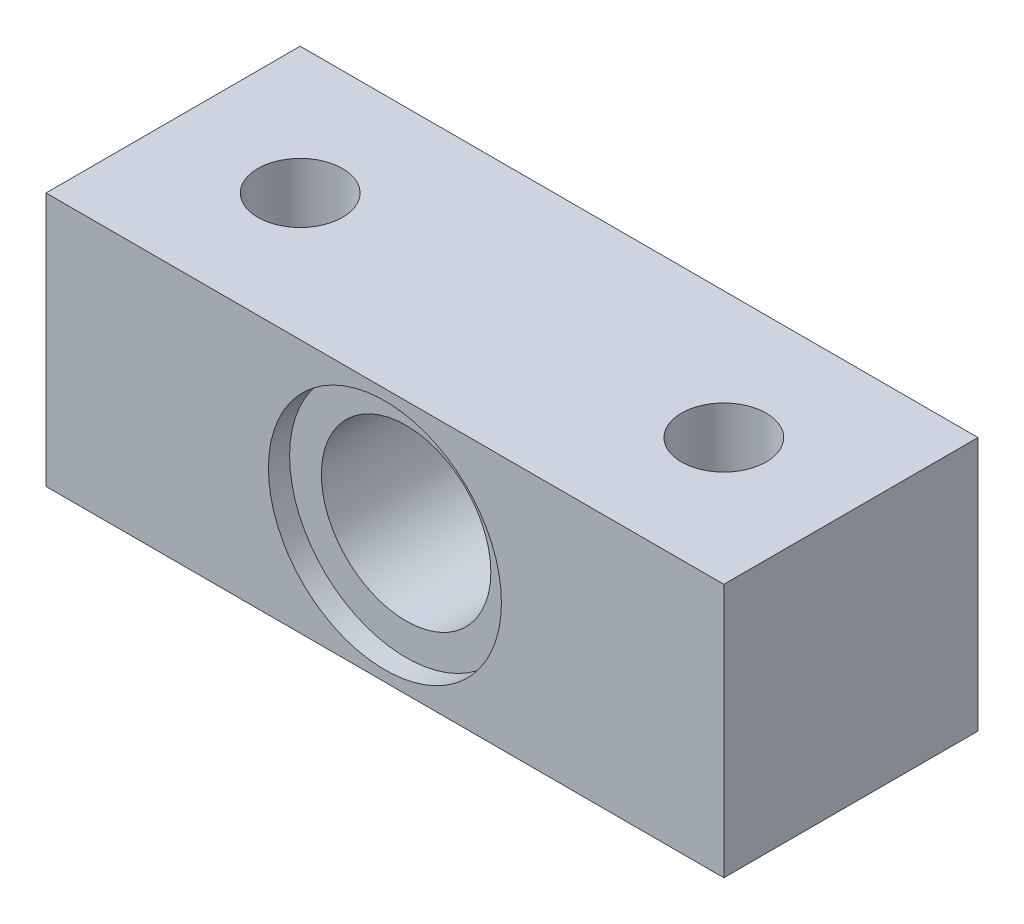
ISO-10303-21;
HEADER;
FILE_DESCRIPTION(('STEP AP214'),'2;1');
FILE_NAME('part.step','',(''),(''),'','','');
FILE_SCHEMA(('AUTOMOTIVE_DESIGN { 1 0 10303 214 1 1 1 1 }'));
ENDSEC;
DATA;
#1=APPLICATION_CONTEXT('core data for automotive mechanical design processes');
#2=APPLICATION_PROTOCOL_DEFINITION('international standard','automotive_design',2000,#1);
#3=PRODUCT_CONTEXT('',#1,'mechanical');
#4=PRODUCT('Part','Part','',(#3));
#5=PRODUCT_RELATED_PRODUCT_CATEGORY('part','',(#4));
#6=PRODUCT_DEFINITION_FORMATION('','',#4);
#7=PRODUCT_DEFINITION_CONTEXT('part definition',#1,'design');
#8=PRODUCT_DEFINITION('design','',#6,#7);
#9=PRODUCT_DEFINITION_SHAPE('','',#8);
#10=(LENGTH_UNIT() NAMED_UNIT(*) SI_UNIT(.MILLI.,.METRE.));
#11=(NAMED_UNIT(*) PLANE_ANGLE_UNIT() SI_UNIT($,.RADIAN.));
#12=(NAMED_UNIT(*) SI_UNIT($,.STERADIAN.) SOLID_ANGLE_UNIT());
#13=UNCERTAINTY_MEASURE_WITH_UNIT(LENGTH_MEASURE(1.E-05),#10,'distance_accuracy_value','');
#14=(GEOMETRIC_REPRESENTATION_CONTEXT(3) GLOBAL_UNCERTAINTY_ASSIGNED_CONTEXT((#13)) GLOBAL_UNIT_ASSIGNED_CONTEXT((#10,
#11,#12)) REPRESENTATION_CONTEXT('',''));
#15=CARTESIAN_POINT('',(0.,0.,0.));
#16=DIRECTION('',(0.,0.,1.));
#17=DIRECTION('',(1.,0.,0.));
#18=AXIS2_PLACEMENT_3D('',#15,#16,#17);
#19=CARTESIAN_POINT('',(15.875,12.8905,9.525));
#20=DIRECTION('',(0.,-1.,0.));
#21=DIRECTION('',(0.,0.,-1.));
#22=AXIS2_PLACEMENT_3D('',#19,#20,#21);
#23=CYLINDRICAL_SURFACE('',#22,3.175);
#24=CARTESIAN_POINT('',(15.875,9.525,9.525));
#25=DIRECTION('',(0.,-1.,0.));
#26=DIRECTION('',(0.,0.,-1.));
#27=AXIS2_PLACEMENT_3D('',#24,#25,#26);
#28=CIRCLE('',#27,3.175);
#29=CARTESIAN_POINT('',(15.875,9.525,6.35));
#30=VERTEX_POINT('',#29);
#31=EDGE_CURVE('E112',#30,#30,#28,.T.);
#32=ORIENTED_EDGE('',*,*,#31,.F.);
#33=EDGE_LOOP('',(#32));
#34=FACE_BOUND('',#33,.T.);
#35=CARTESIAN_POINT('',(15.875,-3.175,9.525));
#36=DIRECTION('',(0.,-1.,0.));
#37=DIRECTION('',(0.,0.,-1.));
#38=AXIS2_PLACEMENT_3D('',#35,#36,#37);
#39=CIRCLE('',#38,3.175);
#40=CARTESIAN_POINT('',(15.875,-3.175,6.35));
#41=VERTEX_POINT('',#40);
#42=EDGE_CURVE('E35',#41,#41,#39,.F.);
#43=ORIENTED_EDGE('',*,*,#42,.F.);
#44=EDGE_LOOP('',(#43));
#45=FACE_BOUND('',#44,.T.);
#46=ADVANCED_FACE('F31',(#34,#45),#23,.F.);
#47=CARTESIAN_POINT('',(-15.875,12.8905,9.525));
#48=DIRECTION('',(0.,-1.,0.));
#49=DIRECTION('',(0.,0.,-1.));
#50=AXIS2_PLACEMENT_3D('',#47,#48,#49);
#51=CYLINDRICAL_SURFACE('',#50,3.175);
#52=CARTESIAN_POINT('',(-15.875,9.525,9.525));
#53=DIRECTION('',(0.,-1.,0.));
#54=DIRECTION('',(0.,0.,-1.));
#55=AXIS2_PLACEMENT_3D('',#52,#53,#54);
#56=CIRCLE('',#55,3.175);
#57=CARTESIAN_POINT('',(-15.875,9.525,6.35));
#58=VERTEX_POINT('',#57);
#59=EDGE_CURVE('E117',#58,#58,#56,.T.);
#60=ORIENTED_EDGE('',*,*,#59,.F.);
#61=EDGE_LOOP('',(#60));
#62=FACE_BOUND('',#61,.T.);
#63=CARTESIAN_POINT('',(-15.875,-3.175,9.525));
#64=DIRECTION('',(0.,-1.,0.));
#65=DIRECTION('',(0.,0.,-1.));
#66=AXIS2_PLACEMENT_3D('',#63,#64,#65);
#67=CIRCLE('',#66,3.175);
#68=CARTESIAN_POINT('',(-15.875,-3.175,6.35));
#69=VERTEX_POINT('',#68);
#70=EDGE_CURVE('E110',#69,#69,#67,.F.);
#71=ORIENTED_EDGE('',*,*,#70,.F.);
#72=EDGE_LOOP('',(#71));
#73=FACE_BOUND('',#72,.T.);
#74=ADVANCED_FACE('F145',(#62,#73),#51,.F.);
#75=CARTESIAN_POINT('',(0.,0.,19.05));
#76=DIRECTION('',(0.,0.,-1.));
#77=DIRECTION('',(-1.,0.,0.));
#78=AXIS2_PLACEMENT_3D('',#75,#76,#77);
#79=CYLINDRICAL_SURFACE('',#78,6.35);
#80=CARTESIAN_POINT('',(0.,0.,0.));
#81=DIRECTION('',(0.,0.,1.));
#82=DIRECTION('',(1.,0.,0.));
#83=AXIS2_PLACEMENT_3D('',#80,#81,#82);
#84=CIRCLE('',#83,6.35);
#85=CARTESIAN_POINT('',(6.35,0.,0.));
#86=VERTEX_POINT('',#85);
#87=EDGE_CURVE('E101',#86,#86,#84,.T.);
#88=ORIENTED_EDGE('',*,*,#87,.F.);
#89=EDGE_LOOP('',(#88));
#90=FACE_BOUND('',#89,.T.);
#91=CARTESIAN_POINT('',(0.,0.,17.4625));
#92=DIRECTION('',(0.,0.,1.));
#93=DIRECTION('',(1.,0.,0.));
#94=AXIS2_PLACEMENT_3D('',#91,#92,#93);
#95=CIRCLE('',#94,6.35);
#96=CARTESIAN_POINT('',(6.35,0.,17.4625));
#97=VERTEX_POINT('',#96);
#98=EDGE_CURVE('E107',#97,#97,#95,.T.);
#99=ORIENTED_EDGE('',*,*,#98,.T.);
#100=EDGE_LOOP('',(#99));
#101=FACE_BOUND('',#100,.T.);
#102=ADVANCED_FACE('F142',(#90,#101),#79,.F.);
#103=CARTESIAN_POINT('',(25.4,9.525,19.05));
#104=DIRECTION('',(0.,0.,-1.));
#105=DIRECTION('',(-1.,0.,0.));
#106=AXIS2_PLACEMENT_3D('',#103,#104,#105);
#107=PLANE('',#106);
#108=CARTESIAN_POINT('',(0.,0.,19.05));
#109=DIRECTION('',(0.,0.,1.));
#110=DIRECTION('',(1.,0.,0.));
#111=AXIS2_PLACEMENT_3D('',#108,#109,#110);
#112=CIRCLE('',#111,8.73125);
#113=CARTESIAN_POINT('',(8.73125,0.,19.05));
#114=VERTEX_POINT('',#113);
#115=EDGE_CURVE('E132',#114,#114,#112,.T.);
#116=ORIENTED_EDGE('',*,*,#115,.F.);
#117=EDGE_LOOP('',(#116));
#118=FACE_BOUND('',#117,.T.);
#119=DIRECTION('',(-1.,0.,0.));
#120=VECTOR('',#119,1.);
#121=CARTESIAN_POINT('',(-25.4,9.525,19.05));
#122=LINE('',#121,#120);
#123=CARTESIAN_POINT('',(25.4,9.525,19.05));
#124=VERTEX_POINT('',#123);
#125=CARTESIAN_POINT('',(-25.4,9.525,19.05));
#126=VERTEX_POINT('',#125);
#127=EDGE_CURVE('E85',#124,#126,#122,.T.);
#128=ORIENTED_EDGE('',*,*,#127,.T.);
#129=DIRECTION('',(0.,-1.,0.));
#130=VECTOR('',#129,1.);
#131=CARTESIAN_POINT('',(-25.4,9.525,19.05));
#132=LINE('',#131,#130);
#133=CARTESIAN_POINT('',(-25.4,-9.525,19.05));
#134=VERTEX_POINT('',#133);
#135=EDGE_CURVE('E80',#126,#134,#132,.T.);
#136=ORIENTED_EDGE('',*,*,#135,.T.);
#137=DIRECTION('',(1.,0.,0.));
#138=VECTOR('',#137,1.);
#139=CARTESIAN_POINT('',(-25.4,-9.525,19.05));
#140=LINE('',#139,#138);
#141=CARTESIAN_POINT('',(25.4,-9.525,19.05));
#142=VERTEX_POINT('',#141);
#143=EDGE_CURVE('E83',#134,#142,#140,.T.);
#144=ORIENTED_EDGE('',*,*,#143,.T.);
#145=DIRECTION('',(0.,1.,0.));
#146=VECTOR('',#145,1.);
#147=CARTESIAN_POINT('',(25.4,9.525,19.05));
#148=LINE('',#147,#146);
#149=EDGE_CURVE('E50',#142,#124,#148,.T.);
#150=ORIENTED_EDGE('',*,*,#149,.T.);
#151=EDGE_LOOP('',(#128,#136,#144,#150));
#152=FACE_BOUND('',#151,.T.);
#153=ADVANCED_FACE('F81',(#118,#152),#107,.F.);
#154=CARTESIAN_POINT('',(25.4,9.525,0.));
#155=DIRECTION('',(0.,0.,-1.));
#156=DIRECTION('',(-1.,0.,0.));
#157=AXIS2_PLACEMENT_3D('',#154,#155,#156);
#158=PLANE('',#157);
#159=DIRECTION('',(-1.,0.,0.));
#160=VECTOR('',#159,1.);
#161=CARTESIAN_POINT('',(-25.4,9.525,0.));
#162=LINE('',#161,#160);
#163=CARTESIAN_POINT('',(25.4,9.525,0.));
#164=VERTEX_POINT('',#163);
#165=CARTESIAN_POINT('',(-25.4,9.525,0.));
#166=VERTEX_POINT('',#165);
#167=EDGE_CURVE('E98',#164,#166,#162,.T.);
#168=ORIENTED_EDGE('',*,*,#167,.F.);
#169=DIRECTION('',(0.,1.,0.));
#170=VECTOR('',#169,1.);
#171=CARTESIAN_POINT('',(25.4,9.525,0.));
#172=LINE('',#171,#170);
#173=CARTESIAN_POINT('',(25.4,-9.525,0.));
#174=VERTEX_POINT('',#173);
#175=EDGE_CURVE('E73',#174,#164,#172,.T.);
#176=ORIENTED_EDGE('',*,*,#175,.F.);
#177=DIRECTION('',(1.,0.,0.));
#178=VECTOR('',#177,1.);
#179=CARTESIAN_POINT('',(-25.4,-9.525,0.));
#180=LINE('',#179,#178);
#181=CARTESIAN_POINT('',(-25.4,-9.525,0.));
#182=VERTEX_POINT('',#181);
#183=EDGE_CURVE('E67',#182,#174,#180,.T.);
#184=ORIENTED_EDGE('',*,*,#183,.F.);
#185=DIRECTION('',(0.,-1.,0.));
#186=VECTOR('',#185,1.);
#187=CARTESIAN_POINT('',(-25.4,9.525,0.));
#188=LINE('',#187,#186);
#189=EDGE_CURVE('E89',#166,#182,#188,.T.);
#190=ORIENTED_EDGE('',*,*,#189,.F.);
#191=EDGE_LOOP('',(#168,#176,#184,#190));
#192=FACE_BOUND('',#191,.T.);
#193=ORIENTED_EDGE('',*,*,#87,.T.);
#194=EDGE_LOOP('',(#193));
#195=FACE_BOUND('',#194,.T.);
#196=ADVANCED_FACE('F140',(#192,#195),#158,.T.);
#197=CARTESIAN_POINT('',(-25.4,9.525,19.05));
#198=DIRECTION('',(0.,-1.,0.));
#199=DIRECTION('',(0.,0.,-1.));
#200=AXIS2_PLACEMENT_3D('',#197,#198,#199);
#201=PLANE('',#200);
#202=ORIENTED_EDGE('',*,*,#31,.T.);
#203=EDGE_LOOP('',(#202));
#204=FACE_BOUND('',#203,.T.);
#205=ORIENTED_EDGE('',*,*,#59,.T.);
#206=EDGE_LOOP('',(#205));
#207=FACE_BOUND('',#206,.T.);
#208=ORIENTED_EDGE('',*,*,#167,.T.);
#209=DIRECTION('',(0.,0.,-1.));
#210=VECTOR('',#209,1.);
#211=CARTESIAN_POINT('',(-25.4,9.525,19.05));
#212=LINE('',#211,#210);
#213=EDGE_CURVE('E11',#126,#166,#212,.T.);
#214=ORIENTED_EDGE('',*,*,#213,.F.);
#215=ORIENTED_EDGE('',*,*,#127,.F.);
#216=DIRECTION('',(0.,0.,-1.));
#217=VECTOR('',#216,1.);
#218=CARTESIAN_POINT('',(25.4,9.525,19.05));
#219=LINE('',#218,#217);
#220=EDGE_CURVE('E94',#124,#164,#219,.T.);
#221=ORIENTED_EDGE('',*,*,#220,.T.);
#222=EDGE_LOOP('',(#208,#214,#215,#221));
#223=FACE_BOUND('',#222,.T.);
#224=ADVANCED_FACE('F33',(#204,#207,#223),#201,.F.);
#225=CARTESIAN_POINT('',(-25.4,9.525,19.05));
#226=DIRECTION('',(1.,0.,0.));
#227=DIRECTION('',(0.,0.,-1.));
#228=AXIS2_PLACEMENT_3D('',#225,#226,#227);
#229=PLANE('',#228);
#230=ORIENTED_EDGE('',*,*,#189,.T.);
#231=DIRECTION('',(0.,0.,-1.));
#232=VECTOR('',#231,1.);
#233=CARTESIAN_POINT('',(-25.4,-9.525,19.05));
#234=LINE('',#233,#232);
#235=EDGE_CURVE('E41',#134,#182,#234,.T.);
#236=ORIENTED_EDGE('',*,*,#235,.F.);
#237=ORIENTED_EDGE('',*,*,#135,.F.);
#238=ORIENTED_EDGE('',*,*,#213,.T.);
#239=EDGE_LOOP('',(#230,#236,#237,#238));
#240=FACE_BOUND('',#239,.T.);
#241=ADVANCED_FACE('F88',(#240),#229,.F.);
#242=CARTESIAN_POINT('',(-25.4,-9.525,19.05));
#243=DIRECTION('',(0.,1.,0.));
#244=DIRECTION('',(0.,0.,1.));
#245=AXIS2_PLACEMENT_3D('',#242,#243,#244);
#246=PLANE('',#245);
#247=CARTESIAN_POINT('',(15.875,-9.525,9.525));
#248=DIRECTION('',(0.,-1.,0.));
#249=DIRECTION('',(0.,0.,-1.));
#250=AXIS2_PLACEMENT_3D('',#247,#248,#249);
#251=CIRCLE('',#250,4.7625);
#252=CARTESIAN_POINT('',(15.875,-9.525,4.7625));
#253=VERTEX_POINT('',#252);
#254=EDGE_CURVE('E127',#253,#253,#251,.T.);
#255=ORIENTED_EDGE('',*,*,#254,.F.);
#256=EDGE_LOOP('',(#255));
#257=FACE_BOUND('',#256,.T.);
#258=CARTESIAN_POINT('',(-15.875,-9.525,9.525));
#259=DIRECTION('',(0.,-1.,0.));
#260=DIRECTION('',(0.,0.,-1.));
#261=AXIS2_PLACEMENT_3D('',#258,#259,#260);
#262=CIRCLE('',#261,4.7625);
#263=CARTESIAN_POINT('',(-15.875,-9.525,4.7625));
#264=VERTEX_POINT('',#263);
#265=EDGE_CURVE('E120',#264,#264,#262,.T.);
#266=ORIENTED_EDGE('',*,*,#265,.F.);
#267=EDGE_LOOP('',(#266));
#268=FACE_BOUND('',#267,.T.);
#269=ORIENTED_EDGE('',*,*,#183,.T.);
#270=DIRECTION('',(0.,0.,-1.));
#271=VECTOR('',#270,1.);
#272=CARTESIAN_POINT('',(25.4,-9.525,19.05));
#273=LINE('',#272,#271);
#274=EDGE_CURVE('E90',#142,#174,#273,.T.);
#275=ORIENTED_EDGE('',*,*,#274,.F.);
#276=ORIENTED_EDGE('',*,*,#143,.F.);
#277=ORIENTED_EDGE('',*,*,#235,.T.);
#278=EDGE_LOOP('',(#269,#275,#276,#277));
#279=FACE_BOUND('',#278,.T.);
#280=ADVANCED_FACE('F92',(#257,#268,#279),#246,.F.);
#281=CARTESIAN_POINT('',(25.4,9.525,19.05));
#282=DIRECTION('',(-1.,0.,0.));
#283=DIRECTION('',(0.,0.,1.));
#284=AXIS2_PLACEMENT_3D('',#281,#282,#283);
#285=PLANE('',#284);
#286=ORIENTED_EDGE('',*,*,#175,.T.);
#287=ORIENTED_EDGE('',*,*,#220,.F.);
#288=ORIENTED_EDGE('',*,*,#149,.F.);
#289=ORIENTED_EDGE('',*,*,#274,.T.);
#290=EDGE_LOOP('',(#286,#287,#288,#289));
#291=FACE_BOUND('',#290,.T.);
#292=ADVANCED_FACE('F159',(#291),#285,.F.);
#293=CARTESIAN_POINT('',(0.,0.,17.4625));
#294=DIRECTION('',(0.,0.,1.));
#295=DIRECTION('',(1.,0.,0.));
#296=AXIS2_PLACEMENT_3D('',#293,#294,#295);
#297=CYLINDRICAL_SURFACE('',#296,8.73125);
#298=CARTESIAN_POINT('',(0.,0.,17.4625));
#299=DIRECTION('',(0.,0.,1.));
#300=DIRECTION('',(1.,0.,0.));
#301=AXIS2_PLACEMENT_3D('',#298,#299,#300);
#302=CIRCLE('',#301,8.73125);
#303=CARTESIAN_POINT('',(8.73125,0.,17.4625));
#304=VERTEX_POINT('',#303);
#305=EDGE_CURVE('E109',#304,#304,#302,.T.);
#306=ORIENTED_EDGE('',*,*,#305,.F.);
#307=EDGE_LOOP('',(#306));
#308=FACE_BOUND('',#307,.T.);
#309=ORIENTED_EDGE('',*,*,#115,.T.);
#310=EDGE_LOOP('',(#309));
#311=FACE_BOUND('',#310,.T.);
#312=ADVANCED_FACE('F153',(#308,#311),#297,.F.);
#313=CARTESIAN_POINT('',(0.,0.,17.4625));
#314=DIRECTION('',(0.,0.,1.));
#315=DIRECTION('',(1.,0.,0.));
#316=AXIS2_PLACEMENT_3D('',#313,#314,#315);
#317=PLANE('',#316);
#318=ORIENTED_EDGE('',*,*,#98,.F.);
#319=EDGE_LOOP('',(#318));
#320=FACE_BOUND('',#319,.T.);
#321=ORIENTED_EDGE('',*,*,#305,.T.);
#322=EDGE_LOOP('',(#321));
#323=FACE_BOUND('',#322,.T.);
#324=ADVANCED_FACE('F149',(#320,#323),#317,.T.);
#325=CARTESIAN_POINT('',(-15.875,-3.175,9.525));
#326=DIRECTION('',(0.,-1.,0.));
#327=DIRECTION('',(0.,0.,-1.));
#328=AXIS2_PLACEMENT_3D('',#325,#326,#327);
#329=PLANE('',#328);
#330=CARTESIAN_POINT('',(-15.875,-3.175,9.525));
#331=DIRECTION('',(0.,-1.,0.));
#332=DIRECTION('',(0.,0.,-1.));
#333=AXIS2_PLACEMENT_3D('',#330,#331,#332);
#334=CIRCLE('',#333,4.7625);
#335=CARTESIAN_POINT('',(-15.875,-3.175,4.7625));
#336=VERTEX_POINT('',#335);
#337=EDGE_CURVE('E113',#336,#336,#334,.T.);
#338=ORIENTED_EDGE('',*,*,#337,.T.);
#339=EDGE_LOOP('',(#338));
#340=FACE_BOUND('',#339,.T.);
#341=ORIENTED_EDGE('',*,*,#70,.T.);
#342=EDGE_LOOP('',(#341));
#343=FACE_BOUND('',#342,.T.);
#344=ADVANCED_FACE('F152',(#340,#343),#329,.T.);
#345=CARTESIAN_POINT('',(-15.875,-3.175,9.525));
#346=DIRECTION('',(0.,-1.,0.));
#347=DIRECTION('',(0.,0.,-1.));
#348=AXIS2_PLACEMENT_3D('',#345,#346,#347);
#349=CYLINDRICAL_SURFACE('',#348,4.7625);
#350=ORIENTED_EDGE('',*,*,#337,.F.);
#351=EDGE_LOOP('',(#350));
#352=FACE_BOUND('',#351,.T.);
#353=ORIENTED_EDGE('',*,*,#265,.T.);
#354=EDGE_LOOP('',(#353));
#355=FACE_BOUND('',#354,.T.);
#356=ADVANCED_FACE('F181',(#352,#355),#349,.F.);
#357=CARTESIAN_POINT('',(15.875,-3.175,9.525));
#358=DIRECTION('',(0.,-1.,0.));
#359=DIRECTION('',(0.,0.,-1.));
#360=AXIS2_PLACEMENT_3D('',#357,#358,#359);
#361=PLANE('',#360);
#362=CARTESIAN_POINT('',(15.875,-3.175,9.525));
#363=DIRECTION('',(0.,-1.,0.));
#364=DIRECTION('',(0.,0.,-1.));
#365=AXIS2_PLACEMENT_3D('',#362,#363,#364);
#366=CIRCLE('',#365,4.7625);
#367=CARTESIAN_POINT('',(15.875,-3.175,4.7625));
#368=VERTEX_POINT('',#367);
#369=EDGE_CURVE('E199',#368,#368,#366,.T.);
#370=ORIENTED_EDGE('',*,*,#369,.T.);
#371=EDGE_LOOP('',(#370));
#372=FACE_BOUND('',#371,.T.);
#373=ORIENTED_EDGE('',*,*,#42,.T.);
#374=EDGE_LOOP('',(#373));
#375=FACE_BOUND('',#374,.T.);
#376=ADVANCED_FACE('F184',(#372,#375),#361,.T.);
#377=CARTESIAN_POINT('',(15.875,-3.175,9.525));
#378=DIRECTION('',(0.,-1.,0.));
#379=DIRECTION('',(0.,0.,-1.));
#380=AXIS2_PLACEMENT_3D('',#377,#378,#379);
#381=CYLINDRICAL_SURFACE('',#380,4.7625);
#382=ORIENTED_EDGE('',*,*,#369,.F.);
#383=EDGE_LOOP('',(#382));
#384=FACE_BOUND('',#383,.T.);
#385=ORIENTED_EDGE('',*,*,#254,.T.);
#386=EDGE_LOOP('',(#385));
#387=FACE_BOUND('',#386,.T.);
#388=ADVANCED_FACE('F188',(#384,#387),#381,.F.);
#389=CLOSED_SHELL('',(#46,#74,#102,#153,#196,#224,#241,#280,#292,#312,#324,#344,#356,#376,#388));
#390=MANIFOLD_SOLID_BREP('B2',#389);
#391=ADVANCED_BREP_SHAPE_REPRESENTATION('',(#18,#390),#14);
#392=SHAPE_DEFINITION_REPRESENTATION(#9,#391);
ENDSEC;
END-ISO-10303-21;
